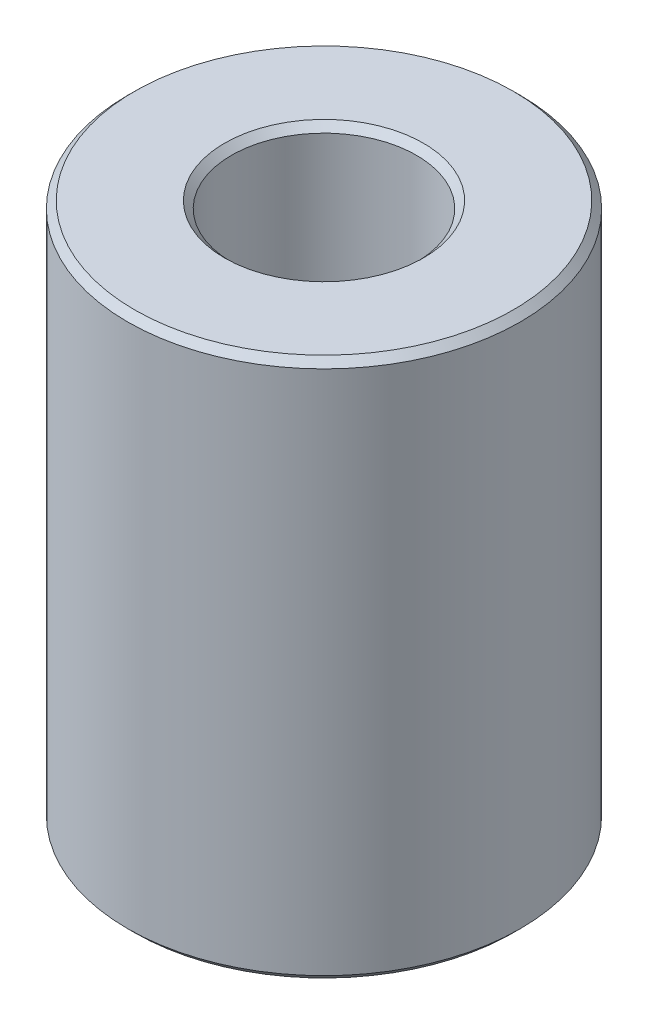
ISO-10303-21;
HEADER;
FILE_DESCRIPTION(('STEP AP214'),'2;1');
FILE_NAME('part.step','',(''),(''),'','','');
FILE_SCHEMA(('AUTOMOTIVE_DESIGN { 1 0 10303 214 1 1 1 1 }'));
ENDSEC;
DATA;
#1=APPLICATION_CONTEXT('core data for automotive mechanical design processes');
#2=APPLICATION_PROTOCOL_DEFINITION('international standard','automotive_design',2000,#1);
#3=PRODUCT_CONTEXT('',#1,'mechanical');
#4=PRODUCT('Part','Part','',(#3));
#5=PRODUCT_RELATED_PRODUCT_CATEGORY('part','',(#4));
#6=PRODUCT_DEFINITION_FORMATION('','',#4);
#7=PRODUCT_DEFINITION_CONTEXT('part definition',#1,'design');
#8=PRODUCT_DEFINITION('design','',#6,#7);
#9=PRODUCT_DEFINITION_SHAPE('','',#8);
#10=(LENGTH_UNIT() NAMED_UNIT(*) SI_UNIT(.MILLI.,.METRE.));
#11=(NAMED_UNIT(*) PLANE_ANGLE_UNIT() SI_UNIT($,.RADIAN.));
#12=(NAMED_UNIT(*) SI_UNIT($,.STERADIAN.) SOLID_ANGLE_UNIT());
#13=UNCERTAINTY_MEASURE_WITH_UNIT(LENGTH_MEASURE(1.E-05),#10,'distance_accuracy_value','');
#14=(GEOMETRIC_REPRESENTATION_CONTEXT(3) GLOBAL_UNCERTAINTY_ASSIGNED_CONTEXT((#13)) GLOBAL_UNIT_ASSIGNED_CONTEXT((#10,
#11,#12)) REPRESENTATION_CONTEXT('',''));
#15=CARTESIAN_POINT('',(0.,0.,0.));
#16=DIRECTION('',(0.,0.,1.));
#17=DIRECTION('',(1.,0.,0.));
#18=AXIS2_PLACEMENT_3D('',#15,#16,#17);
#19=CARTESIAN_POINT('',(0.,151.114426705199,0.));
#20=DIRECTION('',(0.,-1.,0.));
#21=DIRECTION('',(0.,0.,-1.));
#22=AXIS2_PLACEMENT_3D('',#19,#20,#21);
#23=CYLINDRICAL_SURFACE('',#22,55.);
#24=CARTESIAN_POINT('',(0.,1.95216157910816,0.));
#25=DIRECTION('',(0.,1.,0.));
#26=DIRECTION('',(0.,0.,1.));
#27=AXIS2_PLACEMENT_3D('',#24,#25,#26);
#28=CIRCLE('',#27,55.);
#29=CARTESIAN_POINT('',(0.,1.95216157910816,55.));
#30=VERTEX_POINT('',#29);
#31=EDGE_CURVE('E10',#30,#30,#28,.T.);
#32=ORIENTED_EDGE('',*,*,#31,.T.);
#33=EDGE_LOOP('',(#32));
#34=FACE_BOUND('',#33,.T.);
#35=CARTESIAN_POINT('',(0.,149.162265126091,0.));
#36=DIRECTION('',(0.,1.,0.));
#37=DIRECTION('',(0.,0.,1.));
#38=AXIS2_PLACEMENT_3D('',#35,#36,#37);
#39=CIRCLE('',#38,55.);
#40=CARTESIAN_POINT('',(0.,149.162265126091,-55.));
#41=VERTEX_POINT('',#40);
#42=EDGE_CURVE('E50',#41,#41,#39,.F.);
#43=ORIENTED_EDGE('',*,*,#42,.T.);
#44=EDGE_LOOP('',(#43));
#45=FACE_BOUND('',#44,.T.);
#46=ADVANCED_FACE('F39',(#34,#45),#23,.T.);
#47=CARTESIAN_POINT('',(0.,151.114426705199,0.));
#48=DIRECTION('',(0.,1.,0.));
#49=DIRECTION('',(0.,0.,1.));
#50=AXIS2_PLACEMENT_3D('',#47,#48,#49);
#51=PLANE('',#50);
#52=CARTESIAN_POINT('',(0.,151.114426705199,0.));
#53=DIRECTION('',(0.,1.,0.));
#54=DIRECTION('',(0.,0.,1.));
#55=AXIS2_PLACEMENT_3D('',#52,#53,#54);
#56=CIRCLE('',#55,27.8632506070821);
#57=CARTESIAN_POINT('',(0.,151.114426705199,27.8632506070821));
#58=VERTEX_POINT('',#57);
#59=EDGE_CURVE('E58',#58,#58,#56,.F.);
#60=ORIENTED_EDGE('',*,*,#59,.T.);
#61=EDGE_LOOP('',(#60));
#62=FACE_BOUND('',#61,.T.);
#63=CARTESIAN_POINT('',(0.,151.114426705199,0.));
#64=DIRECTION('',(0.,1.,0.));
#65=DIRECTION('',(0.,0.,1.));
#66=AXIS2_PLACEMENT_3D('',#63,#64,#65);
#67=CIRCLE('',#66,53.0478384208919);
#68=CARTESIAN_POINT('',(0.,151.114426705199,-53.0478384208919));
#69=VERTEX_POINT('',#68);
#70=EDGE_CURVE('E61',#69,#69,#67,.T.);
#71=ORIENTED_EDGE('',*,*,#70,.T.);
#72=EDGE_LOOP('',(#71));
#73=FACE_BOUND('',#72,.T.);
#74=ADVANCED_FACE('F88',(#62,#73),#51,.T.);
#75=CARTESIAN_POINT('',(0.,0.,0.));
#76=DIRECTION('',(0.,1.,0.));
#77=DIRECTION('',(0.,0.,1.));
#78=AXIS2_PLACEMENT_3D('',#75,#76,#77);
#79=PLANE('',#78);
#80=CARTESIAN_POINT('',(0.,0.,0.));
#81=DIRECTION('',(0.,1.,0.));
#82=DIRECTION('',(0.,0.,1.));
#83=AXIS2_PLACEMENT_3D('',#80,#81,#82);
#84=CIRCLE('',#83,27.863250607082);
#85=CARTESIAN_POINT('',(0.,0.,27.863250607082));
#86=VERTEX_POINT('',#85);
#87=EDGE_CURVE('E51',#86,#86,#84,.T.);
#88=ORIENTED_EDGE('',*,*,#87,.T.);
#89=EDGE_LOOP('',(#88));
#90=FACE_BOUND('',#89,.T.);
#91=CARTESIAN_POINT('',(0.,0.,0.));
#92=DIRECTION('',(0.,1.,0.));
#93=DIRECTION('',(0.,0.,1.));
#94=AXIS2_PLACEMENT_3D('',#91,#92,#93);
#95=CIRCLE('',#94,53.0478384208918);
#96=CARTESIAN_POINT('',(0.,0.,53.0478384208918));
#97=VERTEX_POINT('',#96);
#98=EDGE_CURVE('E54',#97,#97,#95,.F.);
#99=ORIENTED_EDGE('',*,*,#98,.T.);
#100=EDGE_LOOP('',(#99));
#101=FACE_BOUND('',#100,.T.);
#102=ADVANCED_FACE('F83',(#90,#101),#79,.F.);
#103=CARTESIAN_POINT('',(0.,151.114426705199,0.));
#104=DIRECTION('',(0.,-1.,0.));
#105=DIRECTION('',(0.,0.,-1.));
#106=AXIS2_PLACEMENT_3D('',#103,#104,#105);
#107=CYLINDRICAL_SURFACE('',#106,25.9110890279739);
#108=CARTESIAN_POINT('',(0.,149.162265126091,0.));
#109=DIRECTION('',(0.,1.,0.));
#110=DIRECTION('',(0.,0.,1.));
#111=AXIS2_PLACEMENT_3D('',#108,#109,#110);
#112=CIRCLE('',#111,25.9110890279739);
#113=CARTESIAN_POINT('',(0.,149.162265126091,25.9110890279739));
#114=VERTEX_POINT('',#113);
#115=EDGE_CURVE('E67',#114,#114,#112,.T.);
#116=ORIENTED_EDGE('',*,*,#115,.T.);
#117=EDGE_LOOP('',(#116));
#118=FACE_BOUND('',#117,.T.);
#119=CARTESIAN_POINT('',(0.,1.95216157910816,0.));
#120=DIRECTION('',(0.,1.,0.));
#121=DIRECTION('',(0.,0.,1.));
#122=AXIS2_PLACEMENT_3D('',#119,#120,#121);
#123=CIRCLE('',#122,25.9110890279739);
#124=CARTESIAN_POINT('',(0.,1.95216157910816,25.9110890279739));
#125=VERTEX_POINT('',#124);
#126=EDGE_CURVE('E69',#125,#125,#123,.F.);
#127=ORIENTED_EDGE('',*,*,#126,.T.);
#128=EDGE_LOOP('',(#127));
#129=FACE_BOUND('',#128,.T.);
#130=ADVANCED_FACE('F71',(#118,#129),#107,.F.);
#131=CARTESIAN_POINT('',(0.,149.162265126091,0.));
#132=DIRECTION('',(0.,1.,0.));
#133=DIRECTION('',(0.,0.,1.));
#134=AXIS2_PLACEMENT_3D('',#131,#132,#133);
#135=CONICAL_SURFACE('',#134,25.9110890279739,0.785398163397449);
#136=ORIENTED_EDGE('',*,*,#59,.F.);
#137=EDGE_LOOP('',(#136));
#138=FACE_BOUND('',#137,.T.);
#139=ORIENTED_EDGE('',*,*,#115,.F.);
#140=EDGE_LOOP('',(#139));
#141=FACE_BOUND('',#140,.T.);
#142=ADVANCED_FACE('F77',(#138,#141),#135,.F.);
#143=CARTESIAN_POINT('',(0.,0.,0.));
#144=DIRECTION('',(0.,-1.,0.));
#145=DIRECTION('',(0.,0.,-1.));
#146=AXIS2_PLACEMENT_3D('',#143,#144,#145);
#147=CONICAL_SURFACE('',#146,27.863250607082,0.785398163397449);
#148=ORIENTED_EDGE('',*,*,#126,.F.);
#149=EDGE_LOOP('',(#148));
#150=FACE_BOUND('',#149,.T.);
#151=ORIENTED_EDGE('',*,*,#87,.F.);
#152=EDGE_LOOP('',(#151));
#153=FACE_BOUND('',#152,.T.);
#154=ADVANCED_FACE('F73',(#150,#153),#147,.F.);
#155=CARTESIAN_POINT('',(0.,1.95216157910816,0.));
#156=DIRECTION('',(0.,1.,0.));
#157=DIRECTION('',(0.,0.,1.));
#158=AXIS2_PLACEMENT_3D('',#155,#156,#157);
#159=CONICAL_SURFACE('',#158,55.,0.785398163397457);
#160=ORIENTED_EDGE('',*,*,#98,.F.);
#161=EDGE_LOOP('',(#160));
#162=FACE_BOUND('',#161,.T.);
#163=ORIENTED_EDGE('',*,*,#31,.F.);
#164=EDGE_LOOP('',(#163));
#165=FACE_BOUND('',#164,.T.);
#166=ADVANCED_FACE('F76',(#162,#165),#159,.T.);
#167=CARTESIAN_POINT('',(0.,151.114426705199,0.));
#168=DIRECTION('',(0.,-1.,0.));
#169=DIRECTION('',(0.,0.,-1.));
#170=AXIS2_PLACEMENT_3D('',#167,#168,#169);
#171=CONICAL_SURFACE('',#170,53.0478384208919,0.785398163397443);
#172=CARTESIAN_POINT('',(0.,149.162265126091,-55.));
#173=CARTESIAN_POINT('',(0.,149.18260014254,-54.979664983551));
#174=CARTESIAN_POINT('',(0.,149.202935158989,-54.9593299671019));
#175=CARTESIAN_POINT('',(0.,149.243605191887,-54.9186599342038));
#176=CARTESIAN_POINT('',(0.,149.263940208336,-54.8983249177548));
#177=CARTESIAN_POINT('',(0.,149.304610241234,-54.8576548848567));
#178=CARTESIAN_POINT('',(0.,149.324945257683,-54.8373198684077));
#179=CARTESIAN_POINT('',(0.,149.365615290581,-54.7966498355096));
#180=CARTESIAN_POINT('',(0.,149.38595030703,-54.7763148190605));
#181=CARTESIAN_POINT('',(0.,149.426620339928,-54.7356447861625));
#182=CARTESIAN_POINT('',(0.,149.446955356377,-54.7153097697134));
#183=CARTESIAN_POINT('',(0.,149.487625389276,-54.6746397368153));
#184=CARTESIAN_POINT('',(0.,149.507960405725,-54.6543047203663));
#185=CARTESIAN_POINT('',(0.,149.548630438623,-54.6136346874682));
#186=CARTESIAN_POINT('',(0.,149.568965455072,-54.5932996710192));
#187=CARTESIAN_POINT('',(0.,149.60963548797,-54.5526296381211));
#188=CARTESIAN_POINT('',(0.,149.629970504419,-54.532294621672));
#189=CARTESIAN_POINT('',(0.,149.670640537317,-54.4916245887739));
#190=CARTESIAN_POINT('',(0.,149.690975553766,-54.4712895723249));
#191=CARTESIAN_POINT('',(0.,149.731645586664,-54.4306195394268));
#192=CARTESIAN_POINT('',(0.,149.751980603113,-54.4102845229778));
#193=CARTESIAN_POINT('',(0.,149.792650636011,-54.3696144900797));
#194=CARTESIAN_POINT('',(0.,149.81298565246,-54.3492794736306));
#195=CARTESIAN_POINT('',(0.,149.853655685358,-54.3086094407326));
#196=CARTESIAN_POINT('',(0.,149.873990701807,-54.2882744242835));
#197=CARTESIAN_POINT('',(0.,149.914660734705,-54.2476043913854));
#198=CARTESIAN_POINT('',(0.,149.934995751154,-54.2272693749364));
#199=CARTESIAN_POINT('',(0.,149.975665784053,-54.1865993420383));
#200=CARTESIAN_POINT('',(0.,149.996000800502,-54.1662643255893));
#201=CARTESIAN_POINT('',(0.,150.0366708334,-54.1255942926912));
#202=CARTESIAN_POINT('',(0.,150.057005849849,-54.1052592762421));
#203=CARTESIAN_POINT('',(0.,150.097675882747,-54.064589243344));
#204=CARTESIAN_POINT('',(0.,150.118010899196,-54.044254226895));
#205=CARTESIAN_POINT('',(0.,150.158680932094,-54.0035841939969));
#206=CARTESIAN_POINT('',(0.,150.179015948543,-53.9832491775479));
#207=CARTESIAN_POINT('',(0.,150.219685981441,-53.9425791446498));
#208=CARTESIAN_POINT('',(0.,150.24002099789,-53.9222441282007));
#209=CARTESIAN_POINT('',(0.,150.280691030788,-53.8815740953027));
#210=CARTESIAN_POINT('',(0.,150.301026047237,-53.8612390788536));
#211=CARTESIAN_POINT('',(0.,150.341696080135,-53.8205690459555));
#212=CARTESIAN_POINT('',(0.,150.362031096584,-53.8002340295065));
#213=CARTESIAN_POINT('',(0.,150.402701129482,-53.7595639966084));
#214=CARTESIAN_POINT('',(0.,150.423036145931,-53.7392289801594));
#215=CARTESIAN_POINT('',(0.,150.46370617883,-53.6985589472613));
#216=CARTESIAN_POINT('',(0.,150.484041195279,-53.6782239308122));
#217=CARTESIAN_POINT('',(0.,150.524711228177,-53.6375538979142));
#218=CARTESIAN_POINT('',(0.,150.545046244626,-53.6172188814651));
#219=CARTESIAN_POINT('',(0.,150.585716277524,-53.576548848567));
#220=CARTESIAN_POINT('',(0.,150.606051293973,-53.556213832118));
#221=CARTESIAN_POINT('',(0.,150.646721326871,-53.5155437992199));
#222=CARTESIAN_POINT('',(0.,150.66705634332,-53.4952087827708));
#223=CARTESIAN_POINT('',(0.,150.707726376218,-53.4545387498728));
#224=CARTESIAN_POINT('',(0.,150.728061392667,-53.4342037334237));
#225=CARTESIAN_POINT('',(0.,150.768731425565,-53.3935337005256));
#226=CARTESIAN_POINT('',(0.,150.789066442014,-53.3731986840766));
#227=CARTESIAN_POINT('',(0.,150.829736474912,-53.3325286511785));
#228=CARTESIAN_POINT('',(0.,150.850071491361,-53.3121936347295));
#229=CARTESIAN_POINT('',(0.,150.890741524259,-53.2715236018314));
#230=CARTESIAN_POINT('',(0.,150.911076540709,-53.2511885853823));
#231=CARTESIAN_POINT('',(0.,150.951746573607,-53.2105185524843));
#232=CARTESIAN_POINT('',(0.,150.972081590056,-53.1901835360352));
#233=CARTESIAN_POINT('',(0.,151.012751622954,-53.1495135031371));
#234=CARTESIAN_POINT('',(0.,151.033086639403,-53.1291784866881));
#235=CARTESIAN_POINT('',(0.,151.073756672301,-53.08850845379));
#236=CARTESIAN_POINT('',(0.,151.09409168875,-53.068173437341));
#237=CARTESIAN_POINT('',(0.,151.114426705199,-53.0478384208919));
#238=B_SPLINE_CURVE_WITH_KNOTS('',3,(#172,#173,#174,#175,#176,#177,#178,#179,#180,#181,#182,
#183,#184,#185,#186,#187,#188,#189,#190,#191,#192,#193,#194,#195,#196,#197,#198,#199,#200,#201,
#202,#203,#204,#205,#206,#207,#208,#209,#210,#211,#212,#213,#214,#215,#216,#217,#218,#219,#220,
#221,#222,#223,#224,#225,#226,#227,#228,#229,#230,#231,#232,#233,#234,#235,#236,#237),
.UNSPECIFIED.,.F.,.F.,(4,2,2,2,2,2,2,2,2,2,2,2,2,2,2,2,2,2,2,2,2,2,2,2,2,2,2,2,2,2,2,2,4),(0.,
0.0862741681599364,0.172548336319897,0.258822504479834,0.34509667263979,0.431370840799726,
0.517645008959687,0.603919177119643,0.690193345279579,0.77646751343954,0.862741681599477,
0.949015849759433,1.03529001791939,1.12156418607933,1.20783835423929,1.29411252239922,
1.38038669055918,1.46666085871914,1.55293502687908,1.63920919503903,1.72548336319897,
1.81175753135893,1.89803169951888,1.98430586767882,2.07058003583878,2.15685420399872,
2.24312837215867,2.32940254031863,2.41567670847857,2.50195087663853,2.58822504479846,
2.67449921295842,2.76077338111838),.UNSPECIFIED.);
#239=EDGE_CURVE('BSEAM45',#41,#69,#238,.T.);
#240=ORIENTED_EDGE('',*,*,#42,.F.);
#241=ORIENTED_EDGE('',*,*,#70,.F.);
#242=ORIENTED_EDGE('',*,*,#239,.T.);
#243=ORIENTED_EDGE('',*,*,#239,.F.);
#244=EDGE_LOOP('',(#240,#242,#241,#243));
#245=FACE_BOUND('',#244,.T.);
#246=ADVANCED_FACE('F45',(#245),#171,.T.);
#247=CLOSED_SHELL('',(#46,#74,#102,#130,#142,#154,#166,#246));
#248=MANIFOLD_SOLID_BREP('B2',#247);
#249=ADVANCED_BREP_SHAPE_REPRESENTATION('',(#18,#248),#14);
#250=SHAPE_DEFINITION_REPRESENTATION(#9,#249);
ENDSEC;
END-ISO-10303-21;
